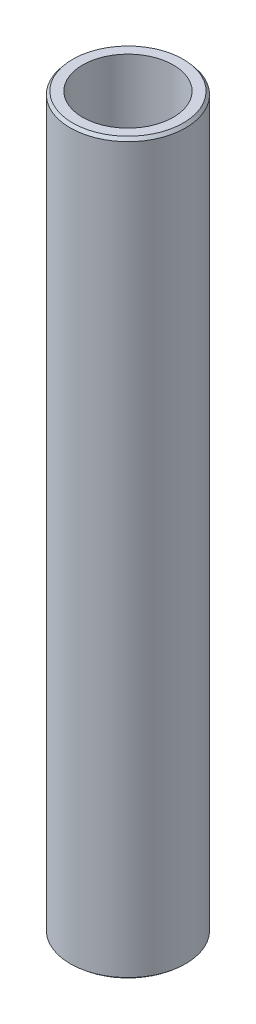
ISO-10303-21;
HEADER;
FILE_DESCRIPTION(('STEP AP214'),'2;1');
FILE_NAME('part.step','',(''),(''),'','','');
FILE_SCHEMA(('AUTOMOTIVE_DESIGN { 1 0 10303 214 1 1 1 1 }'));
ENDSEC;
DATA;
#1=APPLICATION_CONTEXT('core data for automotive mechanical design processes');
#2=APPLICATION_PROTOCOL_DEFINITION('international standard','automotive_design',2000,#1);
#3=PRODUCT_CONTEXT('',#1,'mechanical');
#4=PRODUCT('Part','Part','',(#3));
#5=PRODUCT_RELATED_PRODUCT_CATEGORY('part','',(#4));
#6=PRODUCT_DEFINITION_FORMATION('','',#4);
#7=PRODUCT_DEFINITION_CONTEXT('part definition',#1,'design');
#8=PRODUCT_DEFINITION('design','',#6,#7);
#9=PRODUCT_DEFINITION_SHAPE('','',#8);
#10=(LENGTH_UNIT() NAMED_UNIT(*) SI_UNIT(.MILLI.,.METRE.));
#11=(NAMED_UNIT(*) PLANE_ANGLE_UNIT() SI_UNIT($,.RADIAN.));
#12=(NAMED_UNIT(*) SI_UNIT($,.STERADIAN.) SOLID_ANGLE_UNIT());
#13=UNCERTAINTY_MEASURE_WITH_UNIT(LENGTH_MEASURE(1.E-05),#10,'distance_accuracy_value','');
#14=(GEOMETRIC_REPRESENTATION_CONTEXT(3) GLOBAL_UNCERTAINTY_ASSIGNED_CONTEXT((#13)) GLOBAL_UNIT_ASSIGNED_CONTEXT((#10,
#11,#12)) REPRESENTATION_CONTEXT('',''));
#15=CARTESIAN_POINT('',(0.,0.,0.));
#16=DIRECTION('',(0.,0.,1.));
#17=DIRECTION('',(1.,0.,0.));
#18=AXIS2_PLACEMENT_3D('',#15,#16,#17);
#19=CARTESIAN_POINT('',(0.,600.,0.));
#20=DIRECTION('',(0.,-1.,0.));
#21=DIRECTION('',(0.,0.,-1.));
#22=AXIS2_PLACEMENT_3D('',#19,#20,#21);
#23=CYLINDRICAL_SURFACE('',#22,47.5);
#24=CARTESIAN_POINT('',(0.,597.546868113833,0.));
#25=DIRECTION('',(0.,1.,0.));
#26=DIRECTION('',(0.,0.,1.));
#27=AXIS2_PLACEMENT_3D('',#24,#25,#26);
#28=CIRCLE('',#27,47.5);
#29=CARTESIAN_POINT('',(0.,597.546868113833,47.5));
#30=VERTEX_POINT('',#29);
#31=EDGE_CURVE('E50',#30,#30,#28,.F.);
#32=ORIENTED_EDGE('',*,*,#31,.T.);
#33=EDGE_LOOP('',(#32));
#34=FACE_BOUND('',#33,.T.);
#35=CARTESIAN_POINT('',(0.,2.03292742525674,0.));
#36=DIRECTION('',(0.,1.,0.));
#37=DIRECTION('',(0.,0.,1.));
#38=AXIS2_PLACEMENT_3D('',#35,#36,#37);
#39=CIRCLE('',#38,47.5);
#40=CARTESIAN_POINT('',(0.,2.03292742525674,47.5));
#41=VERTEX_POINT('',#40);
#42=EDGE_CURVE('E51',#41,#41,#39,.T.);
#43=ORIENTED_EDGE('',*,*,#42,.T.);
#44=EDGE_LOOP('',(#43));
#45=FACE_BOUND('',#44,.T.);
#46=ADVANCED_FACE('F39',(#34,#45),#23,.T.);
#47=CARTESIAN_POINT('',(0.,600.,0.));
#48=DIRECTION('',(0.,1.,0.));
#49=DIRECTION('',(0.,0.,1.));
#50=AXIS2_PLACEMENT_3D('',#47,#48,#49);
#51=PLANE('',#50);
#52=CARTESIAN_POINT('',(0.,600.,0.));
#53=DIRECTION('',(0.,1.,0.));
#54=DIRECTION('',(0.,0.,1.));
#55=AXIS2_PLACEMENT_3D('',#52,#53,#54);
#56=CIRCLE('',#55,45.4670725747431);
#57=CARTESIAN_POINT('',(0.,600.,45.4670725747431));
#58=VERTEX_POINT('',#57);
#59=EDGE_CURVE('E54',#58,#58,#56,.T.);
#60=ORIENTED_EDGE('',*,*,#59,.T.);
#61=EDGE_LOOP('',(#60));
#62=FACE_BOUND('',#61,.T.);
#63=CARTESIAN_POINT('',(0.,600.,0.));
#64=DIRECTION('',(0.,1.,0.));
#65=DIRECTION('',(0.,0.,1.));
#66=AXIS2_PLACEMENT_3D('',#63,#64,#65);
#67=CIRCLE('',#66,37.3178151291104);
#68=CARTESIAN_POINT('',(0.,600.,37.3178151291104));
#69=VERTEX_POINT('',#68);
#70=EDGE_CURVE('E58',#69,#69,#67,.T.);
#71=ORIENTED_EDGE('',*,*,#70,.F.);
#72=EDGE_LOOP('',(#71));
#73=FACE_BOUND('',#72,.T.);
#74=ADVANCED_FACE('F69',(#62,#73),#51,.T.);
#75=CARTESIAN_POINT('',(0.,0.,0.));
#76=DIRECTION('',(0.,1.,0.));
#77=DIRECTION('',(0.,0.,1.));
#78=AXIS2_PLACEMENT_3D('',#75,#76,#77);
#79=PLANE('',#78);
#80=CARTESIAN_POINT('',(0.,0.,0.));
#81=DIRECTION('',(0.,1.,0.));
#82=DIRECTION('',(0.,0.,1.));
#83=AXIS2_PLACEMENT_3D('',#80,#81,#82);
#84=CIRCLE('',#83,45.0468681138336);
#85=CARTESIAN_POINT('',(0.,0.,45.0468681138336));
#86=VERTEX_POINT('',#85);
#87=EDGE_CURVE('E10',#86,#86,#84,.F.);
#88=ORIENTED_EDGE('',*,*,#87,.T.);
#89=EDGE_LOOP('',(#88));
#90=FACE_BOUND('',#89,.T.);
#91=CARTESIAN_POINT('',(0.,0.,0.));
#92=DIRECTION('',(0.,1.,0.));
#93=DIRECTION('',(0.,0.,1.));
#94=AXIS2_PLACEMENT_3D('',#91,#92,#93);
#95=CIRCLE('',#94,37.3178151291104);
#96=CARTESIAN_POINT('',(0.,0.,37.3178151291104));
#97=VERTEX_POINT('',#96);
#98=EDGE_CURVE('E63',#97,#97,#95,.T.);
#99=ORIENTED_EDGE('',*,*,#98,.T.);
#100=EDGE_LOOP('',(#99));
#101=FACE_BOUND('',#100,.T.);
#102=ADVANCED_FACE('F75',(#90,#101),#79,.F.);
#103=CARTESIAN_POINT('',(0.,600.,0.));
#104=DIRECTION('',(0.,-1.,0.));
#105=DIRECTION('',(0.,0.,-1.));
#106=AXIS2_PLACEMENT_3D('',#103,#104,#105);
#107=CYLINDRICAL_SURFACE('',#106,37.3178151291104);
#108=ORIENTED_EDGE('',*,*,#70,.T.);
#109=EDGE_LOOP('',(#108));
#110=FACE_BOUND('',#109,.T.);
#111=ORIENTED_EDGE('',*,*,#98,.F.);
#112=EDGE_LOOP('',(#111));
#113=FACE_BOUND('',#112,.T.);
#114=ADVANCED_FACE('F70',(#110,#113),#107,.F.);
#115=CARTESIAN_POINT('',(0.,600.,0.));
#116=DIRECTION('',(0.,-1.,0.));
#117=DIRECTION('',(0.,0.,-1.));
#118=AXIS2_PLACEMENT_3D('',#115,#116,#117);
#119=CONICAL_SURFACE('',#118,45.4670725747431,0.692001727675419);
#120=ORIENTED_EDGE('',*,*,#31,.F.);
#121=EDGE_LOOP('',(#120));
#122=FACE_BOUND('',#121,.T.);
#123=ORIENTED_EDGE('',*,*,#59,.F.);
#124=EDGE_LOOP('',(#123));
#125=FACE_BOUND('',#124,.T.);
#126=ADVANCED_FACE('F81',(#122,#125),#119,.T.);
#127=CARTESIAN_POINT('',(0.,2.03292742525674,0.));
#128=DIRECTION('',(0.,1.,0.));
#129=DIRECTION('',(0.,0.,1.));
#130=AXIS2_PLACEMENT_3D('',#127,#128,#129);
#131=CONICAL_SURFACE('',#130,47.5,0.878794599119481);
#132=ORIENTED_EDGE('',*,*,#87,.F.);
#133=EDGE_LOOP('',(#132));
#134=FACE_BOUND('',#133,.T.);
#135=ORIENTED_EDGE('',*,*,#42,.F.);
#136=EDGE_LOOP('',(#135));
#137=FACE_BOUND('',#136,.T.);
#138=ADVANCED_FACE('F45',(#134,#137),#131,.T.);
#139=CLOSED_SHELL('',(#46,#74,#102,#114,#126,#138));
#140=MANIFOLD_SOLID_BREP('B2',#139);
#141=ADVANCED_BREP_SHAPE_REPRESENTATION('',(#18,#140),#14);
#142=SHAPE_DEFINITION_REPRESENTATION(#9,#141);
ENDSEC;
END-ISO-10303-21;
